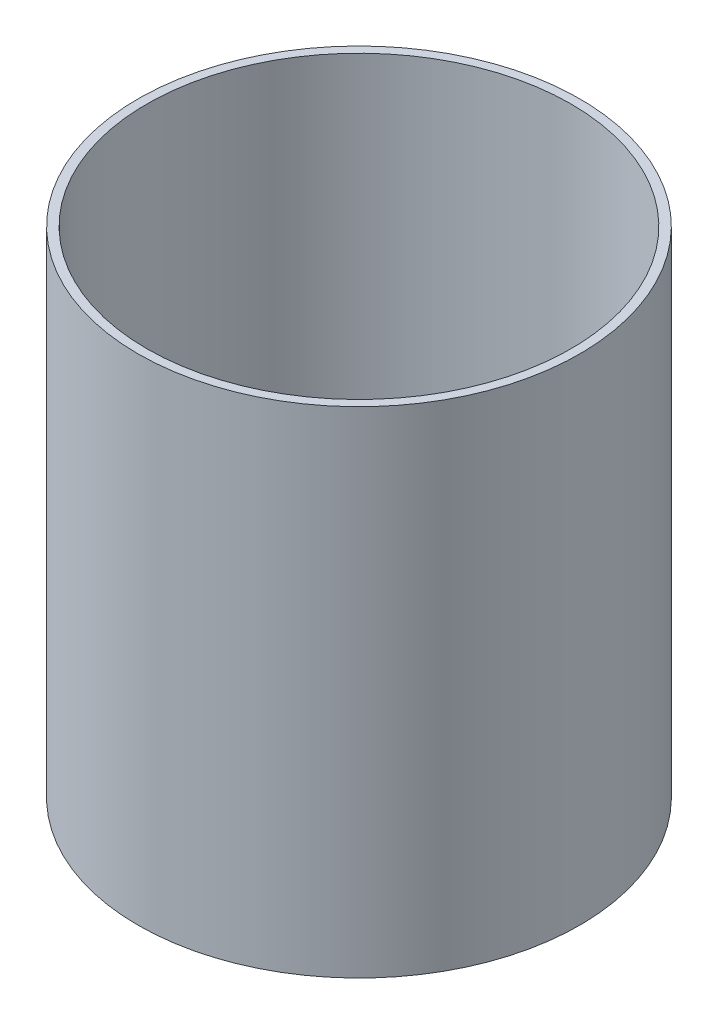
ISO-10303-21;
HEADER;
FILE_DESCRIPTION(('STEP AP214'),'2;1');
FILE_NAME('part.step','',(''),(''),'','','');
FILE_SCHEMA(('AUTOMOTIVE_DESIGN { 1 0 10303 214 1 1 1 1 }'));
ENDSEC;
DATA;
#1=APPLICATION_CONTEXT('core data for automotive mechanical design processes');
#2=APPLICATION_PROTOCOL_DEFINITION('international standard','automotive_design',2000,#1);
#3=PRODUCT_CONTEXT('',#1,'mechanical');
#4=PRODUCT('Part','Part','',(#3));
#5=PRODUCT_RELATED_PRODUCT_CATEGORY('part','',(#4));
#6=PRODUCT_DEFINITION_FORMATION('','',#4);
#7=PRODUCT_DEFINITION_CONTEXT('part definition',#1,'design');
#8=PRODUCT_DEFINITION('design','',#6,#7);
#9=PRODUCT_DEFINITION_SHAPE('','',#8);
#10=(LENGTH_UNIT() NAMED_UNIT(*) SI_UNIT(.MILLI.,.METRE.));
#11=(NAMED_UNIT(*) PLANE_ANGLE_UNIT() SI_UNIT($,.RADIAN.));
#12=(NAMED_UNIT(*) SI_UNIT($,.STERADIAN.) SOLID_ANGLE_UNIT());
#13=UNCERTAINTY_MEASURE_WITH_UNIT(LENGTH_MEASURE(1.E-05),#10,'distance_accuracy_value','');
#14=(GEOMETRIC_REPRESENTATION_CONTEXT(3) GLOBAL_UNCERTAINTY_ASSIGNED_CONTEXT((#13)) GLOBAL_UNIT_ASSIGNED_CONTEXT((#10,
#11,#12)) REPRESENTATION_CONTEXT('',''));
#15=CARTESIAN_POINT('',(0.,0.,0.));
#16=DIRECTION('',(0.,0.,1.));
#17=DIRECTION('',(1.,0.,0.));
#18=AXIS2_PLACEMENT_3D('',#15,#16,#17);
#19=CARTESIAN_POINT('',(0.,2800.000000116,0.));
#20=DIRECTION('',(0.,1.,0.));
#21=DIRECTION('',(0.,0.,1.));
#22=AXIS2_PLACEMENT_3D('',#19,#20,#21);
#23=PLANE('',#22);
#24=CARTESIAN_POINT('',(0.,2800.000000116,0.));
#25=DIRECTION('',(0.,1.,0.));
#26=DIRECTION('',(0.,0.,1.));
#27=AXIS2_PLACEMENT_3D('',#24,#25,#26);
#28=CIRCLE('',#27,1250.);
#29=CARTESIAN_POINT('',(0.,2800.000000116,1250.));
#30=VERTEX_POINT('',#29);
#31=EDGE_CURVE('E10',#30,#30,#28,.T.);
#32=ORIENTED_EDGE('',*,*,#31,.T.);
#33=EDGE_LOOP('',(#32));
#34=FACE_BOUND('',#33,.T.);
#35=CARTESIAN_POINT('',(0.,2800.000000116,0.));
#36=DIRECTION('',(0.,1.,0.));
#37=DIRECTION('',(0.,0.,1.));
#38=AXIS2_PLACEMENT_3D('',#35,#36,#37);
#39=CIRCLE('',#38,1200.);
#40=CARTESIAN_POINT('',(0.,2800.000000116,1200.));
#41=VERTEX_POINT('',#40);
#42=EDGE_CURVE('E48',#41,#41,#39,.T.);
#43=ORIENTED_EDGE('',*,*,#42,.F.);
#44=EDGE_LOOP('',(#43));
#45=FACE_BOUND('',#44,.T.);
#46=ADVANCED_FACE('F37',(#34,#45),#23,.T.);
#47=CARTESIAN_POINT('',(0.,0.,0.));
#48=DIRECTION('',(0.,1.,0.));
#49=DIRECTION('',(0.,0.,1.));
#50=AXIS2_PLACEMENT_3D('',#47,#48,#49);
#51=PLANE('',#50);
#52=CARTESIAN_POINT('',(0.,0.,0.));
#53=DIRECTION('',(0.,1.,0.));
#54=DIRECTION('',(0.,0.,1.));
#55=AXIS2_PLACEMENT_3D('',#52,#53,#54);
#56=CIRCLE('',#55,1250.);
#57=CARTESIAN_POINT('',(0.,0.,1250.));
#58=VERTEX_POINT('',#57);
#59=EDGE_CURVE('E41',#58,#58,#56,.T.);
#60=ORIENTED_EDGE('',*,*,#59,.F.);
#61=EDGE_LOOP('',(#60));
#62=FACE_BOUND('',#61,.T.);
#63=CARTESIAN_POINT('',(0.,0.,0.));
#64=DIRECTION('',(0.,1.,0.));
#65=DIRECTION('',(0.,0.,1.));
#66=AXIS2_PLACEMENT_3D('',#63,#64,#65);
#67=CIRCLE('',#66,1200.);
#68=CARTESIAN_POINT('',(0.,0.,1200.));
#69=VERTEX_POINT('',#68);
#70=EDGE_CURVE('E50',#69,#69,#67,.T.);
#71=ORIENTED_EDGE('',*,*,#70,.T.);
#72=EDGE_LOOP('',(#71));
#73=FACE_BOUND('',#72,.T.);
#74=ADVANCED_FACE('F60',(#62,#73),#51,.F.);
#75=CARTESIAN_POINT('',(0.,2800.000000116,0.));
#76=DIRECTION('',(0.,-1.,0.));
#77=DIRECTION('',(0.,0.,-1.));
#78=AXIS2_PLACEMENT_3D('',#75,#76,#77);
#79=CYLINDRICAL_SURFACE('',#78,1250.);
#80=ORIENTED_EDGE('',*,*,#31,.F.);
#81=EDGE_LOOP('',(#80));
#82=FACE_BOUND('',#81,.T.);
#83=ORIENTED_EDGE('',*,*,#59,.T.);
#84=EDGE_LOOP('',(#83));
#85=FACE_BOUND('',#84,.T.);
#86=ADVANCED_FACE('F39',(#82,#85),#79,.T.);
#87=CARTESIAN_POINT('',(0.,2800.000000116,0.));
#88=DIRECTION('',(0.,-1.,0.));
#89=DIRECTION('',(0.,0.,-1.));
#90=AXIS2_PLACEMENT_3D('',#87,#88,#89);
#91=CYLINDRICAL_SURFACE('',#90,1200.);
#92=ORIENTED_EDGE('',*,*,#42,.T.);
#93=EDGE_LOOP('',(#92));
#94=FACE_BOUND('',#93,.T.);
#95=ORIENTED_EDGE('',*,*,#70,.F.);
#96=EDGE_LOOP('',(#95));
#97=FACE_BOUND('',#96,.T.);
#98=ADVANCED_FACE('F56',(#94,#97),#91,.F.);
#99=CLOSED_SHELL('',(#46,#74,#86,#98));
#100=MANIFOLD_SOLID_BREP('B2',#99);
#101=ADVANCED_BREP_SHAPE_REPRESENTATION('',(#18,#100),#14);
#102=SHAPE_DEFINITION_REPRESENTATION(#9,#101);
ENDSEC;
END-ISO-10303-21;
